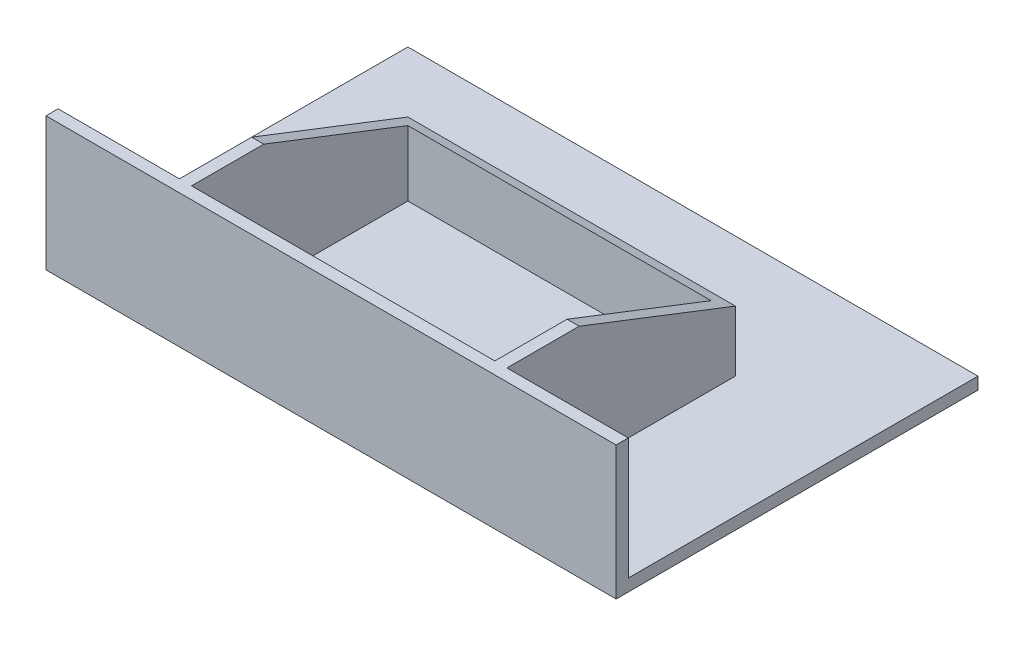
ISO-10303-21;
HEADER;
FILE_DESCRIPTION(('STEP AP214'),'2;1');
FILE_NAME('part.step','',(''),(''),'','','');
FILE_SCHEMA(('AUTOMOTIVE_DESIGN { 1 0 10303 214 1 1 1 1 }'));
ENDSEC;
DATA;
#1=APPLICATION_CONTEXT('core data for automotive mechanical design processes');
#2=APPLICATION_PROTOCOL_DEFINITION('international standard','automotive_design',2000,#1);
#3=PRODUCT_CONTEXT('',#1,'mechanical');
#4=PRODUCT('Part','Part','',(#3));
#5=PRODUCT_RELATED_PRODUCT_CATEGORY('part','',(#4));
#6=PRODUCT_DEFINITION_FORMATION('','',#4);
#7=PRODUCT_DEFINITION_CONTEXT('part definition',#1,'design');
#8=PRODUCT_DEFINITION('design','',#6,#7);
#9=PRODUCT_DEFINITION_SHAPE('','',#8);
#10=(LENGTH_UNIT() NAMED_UNIT(*) SI_UNIT(.MILLI.,.METRE.));
#11=(NAMED_UNIT(*) PLANE_ANGLE_UNIT() SI_UNIT($,.RADIAN.));
#12=(NAMED_UNIT(*) SI_UNIT($,.STERADIAN.) SOLID_ANGLE_UNIT());
#13=UNCERTAINTY_MEASURE_WITH_UNIT(LENGTH_MEASURE(1.E-05),#10,'distance_accuracy_value','');
#14=(GEOMETRIC_REPRESENTATION_CONTEXT(3) GLOBAL_UNCERTAINTY_ASSIGNED_CONTEXT((#13)) GLOBAL_UNIT_ASSIGNED_CONTEXT((#10,
#11,#12)) REPRESENTATION_CONTEXT('',''));
#15=CARTESIAN_POINT('',(0.,0.,0.));
#16=DIRECTION('',(0.,0.,1.));
#17=DIRECTION('',(1.,0.,0.));
#18=AXIS2_PLACEMENT_3D('',#15,#16,#17);
#19=CARTESIAN_POINT('',(0.,0.,0.));
#20=DIRECTION('',(0.,0.,1.));
#21=DIRECTION('',(1.,0.,0.));
#22=AXIS2_PLACEMENT_3D('',#19,#20,#21);
#23=PLANE('',#22);
#24=DIRECTION('',(-1.,0.,0.));
#25=VECTOR('',#24,1.);
#26=CARTESIAN_POINT('',(-47.,0.,0.));
#27=LINE('',#26,#25);
#28=CARTESIAN_POINT('',(-27.,0.,0.));
#29=VERTEX_POINT('',#28);
#30=CARTESIAN_POINT('',(-47.,0.,0.));
#31=VERTEX_POINT('',#30);
#32=EDGE_CURVE('E250',#29,#31,#27,.T.);
#33=ORIENTED_EDGE('',*,*,#32,.T.);
#34=DIRECTION('',(0.,-1.,0.));
#35=VECTOR('',#34,1.);
#36=CARTESIAN_POINT('',(-47.,20.,0.));
#37=LINE('',#36,#35);
#38=CARTESIAN_POINT('',(-47.,20.,0.));
#39=VERTEX_POINT('',#38);
#40=EDGE_CURVE('E100',#39,#31,#37,.T.);
#41=ORIENTED_EDGE('',*,*,#40,.F.);
#42=DIRECTION('',(-1.,0.,0.));
#43=VECTOR('',#42,1.);
#44=CARTESIAN_POINT('',(-47.,20.,0.));
#45=LINE('',#44,#43);
#46=CARTESIAN_POINT('',(-27.,20.,0.));
#47=VERTEX_POINT('',#46);
#48=EDGE_CURVE('E79',#47,#39,#45,.T.);
#49=ORIENTED_EDGE('',*,*,#48,.F.);
#50=DIRECTION('',(0.,-1.,0.));
#51=VECTOR('',#50,1.);
#52=CARTESIAN_POINT('',(-27.,0.,0.));
#53=LINE('',#52,#51);
#54=EDGE_CURVE('E83',#47,#29,#53,.T.);
#55=ORIENTED_EDGE('',*,*,#54,.T.);
#56=EDGE_LOOP('',(#33,#41,#49,#55));
#57=FACE_BOUND('',#56,.T.);
#58=ADVANCED_FACE('F37',(#57),#23,.F.);
#59=CARTESIAN_POINT('',(25.,0.,0.));
#60=VERTEX_POINT('',#59);
#61=CARTESIAN_POINT('',(-25.,0.,0.));
#62=VERTEX_POINT('',#61);
#63=EDGE_CURVE('E248',#60,#62,#27,.T.);
#64=ORIENTED_EDGE('',*,*,#63,.T.);
#65=DIRECTION('',(0.,1.,0.));
#66=VECTOR('',#65,1.);
#67=CARTESIAN_POINT('',(-25.,-61.4143647298425,0.));
#68=LINE('',#67,#66);
#69=CARTESIAN_POINT('',(-25.,20.,0.));
#70=VERTEX_POINT('',#69);
#71=EDGE_CURVE('E151',#62,#70,#68,.T.);
#72=ORIENTED_EDGE('',*,*,#71,.T.);
#73=CARTESIAN_POINT('',(25.,20.,0.));
#74=VERTEX_POINT('',#73);
#75=EDGE_CURVE('E101',#74,#70,#45,.T.);
#76=ORIENTED_EDGE('',*,*,#75,.F.);
#77=DIRECTION('',(0.,1.,0.));
#78=VECTOR('',#77,1.);
#79=CARTESIAN_POINT('',(25.,-61.4143647298425,0.));
#80=LINE('',#79,#78);
#81=EDGE_CURVE('E157',#60,#74,#80,.T.);
#82=ORIENTED_EDGE('',*,*,#81,.F.);
#83=EDGE_LOOP('',(#64,#72,#76,#82));
#84=FACE_BOUND('',#83,.T.);
#85=ADVANCED_FACE('F222',(#84),#23,.F.);
#86=CARTESIAN_POINT('',(47.,0.,0.));
#87=VERTEX_POINT('',#86);
#88=CARTESIAN_POINT('',(27.,0.,0.));
#89=VERTEX_POINT('',#88);
#90=EDGE_CURVE('E239',#87,#89,#27,.T.);
#91=ORIENTED_EDGE('',*,*,#90,.T.);
#92=DIRECTION('',(0.,-1.,0.));
#93=VECTOR('',#92,1.);
#94=CARTESIAN_POINT('',(27.,0.,0.));
#95=LINE('',#94,#93);
#96=CARTESIAN_POINT('',(27.,20.,0.));
#97=VERTEX_POINT('',#96);
#98=EDGE_CURVE('E182',#97,#89,#95,.T.);
#99=ORIENTED_EDGE('',*,*,#98,.F.);
#100=CARTESIAN_POINT('',(47.,20.,0.));
#101=VERTEX_POINT('',#100);
#102=EDGE_CURVE('E104',#101,#97,#45,.T.);
#103=ORIENTED_EDGE('',*,*,#102,.F.);
#104=DIRECTION('',(0.,1.,0.));
#105=VECTOR('',#104,1.);
#106=CARTESIAN_POINT('',(47.,20.,0.));
#107=LINE('',#106,#105);
#108=EDGE_CURVE('E102',#87,#101,#107,.T.);
#109=ORIENTED_EDGE('',*,*,#108,.F.);
#110=EDGE_LOOP('',(#91,#99,#103,#109));
#111=FACE_BOUND('',#110,.T.);
#112=ADVANCED_FACE('F207',(#111),#23,.F.);
#113=CARTESIAN_POINT('',(27.,5.,-4.));
#114=DIRECTION('',(-1.,0.,0.));
#115=DIRECTION('',(0.,0.,1.));
#116=AXIS2_PLACEMENT_3D('',#113,#114,#115);
#117=CYLINDRICAL_SURFACE('',#116,2.1);
#118=CARTESIAN_POINT('',(-25.,5.,-4.));
#119=DIRECTION('',(-1.,0.,0.));
#120=DIRECTION('',(0.,0.,1.));
#121=AXIS2_PLACEMENT_3D('',#118,#119,#120);
#122=CIRCLE('',#121,2.1);
#123=CARTESIAN_POINT('',(-25.,5.,-1.9));
#124=VERTEX_POINT('',#123);
#125=EDGE_CURVE('E165',#124,#124,#122,.T.);
#126=ORIENTED_EDGE('',*,*,#125,.F.);
#127=EDGE_LOOP('',(#126));
#128=FACE_BOUND('',#127,.T.);
#129=CARTESIAN_POINT('',(-27.,5.,-4.));
#130=DIRECTION('',(1.,0.,0.));
#131=DIRECTION('',(0.,0.,-1.));
#132=AXIS2_PLACEMENT_3D('',#129,#130,#131);
#133=CIRCLE('',#132,2.1);
#134=CARTESIAN_POINT('',(-27.,5.,-6.1));
#135=VERTEX_POINT('',#134);
#136=EDGE_CURVE('E169',#135,#135,#133,.T.);
#137=ORIENTED_EDGE('',*,*,#136,.F.);
#138=EDGE_LOOP('',(#137));
#139=FACE_BOUND('',#138,.T.);
#140=ADVANCED_FACE('F203',(#128,#139),#117,.F.);
#141=CARTESIAN_POINT('',(27.,0.,0.));
#142=DIRECTION('',(-1.,0.,0.));
#143=DIRECTION('',(0.,0.,1.));
#144=AXIS2_PLACEMENT_3D('',#141,#142,#143);
#145=PLANE('',#144);
#146=DIRECTION('',(0.,0.,-1.));
#147=VECTOR('',#146,1.);
#148=CARTESIAN_POINT('',(27.,0.,-37.6612421989213));
#149=LINE('',#148,#147);
#150=CARTESIAN_POINT('',(27.,0.,-37.6612421989213));
#151=VERTEX_POINT('',#150);
#152=EDGE_CURVE('E96',#89,#151,#149,.T.);
#153=ORIENTED_EDGE('',*,*,#152,.T.);
#154=DIRECTION('',(0.,1.,0.));
#155=VECTOR('',#154,1.);
#156=CARTESIAN_POINT('',(27.,10.,-37.6612421989213));
#157=LINE('',#156,#155);
#158=CARTESIAN_POINT('',(27.,10.,-37.6612421989213));
#159=VERTEX_POINT('',#158);
#160=EDGE_CURVE('E177',#151,#159,#157,.T.);
#161=ORIENTED_EDGE('',*,*,#160,.T.);
#162=DIRECTION('',(0.,0.361963982515908,0.932192080722221));
#163=VECTOR('',#162,1.);
#164=CARTESIAN_POINT('',(27.,20.,-11.9075173602559));
#165=LINE('',#164,#163);
#166=CARTESIAN_POINT('',(27.,20.,-11.9075173602559));
#167=VERTEX_POINT('',#166);
#168=EDGE_CURVE('E54',#159,#167,#165,.T.);
#169=ORIENTED_EDGE('',*,*,#168,.T.);
#170=DIRECTION('',(0.,0.,1.));
#171=VECTOR('',#170,1.);
#172=CARTESIAN_POINT('',(27.,20.,0.));
#173=LINE('',#172,#171);
#174=EDGE_CURVE('E180',#167,#97,#173,.T.);
#175=ORIENTED_EDGE('',*,*,#174,.T.);
#176=ORIENTED_EDGE('',*,*,#98,.T.);
#177=EDGE_LOOP('',(#153,#161,#169,#175,#176));
#178=FACE_BOUND('',#177,.T.);
#179=CARTESIAN_POINT('',(27.,5.,-4.));
#180=DIRECTION('',(1.,0.,0.));
#181=DIRECTION('',(0.,0.,-1.));
#182=AXIS2_PLACEMENT_3D('',#179,#180,#181);
#183=CIRCLE('',#182,2.1);
#184=CARTESIAN_POINT('',(27.,5.,-6.1));
#185=VERTEX_POINT('',#184);
#186=EDGE_CURVE('E170',#185,#185,#183,.T.);
#187=ORIENTED_EDGE('',*,*,#186,.F.);
#188=EDGE_LOOP('',(#187));
#189=FACE_BOUND('',#188,.T.);
#190=ADVANCED_FACE('F206',(#178,#189),#145,.F.);
#191=CARTESIAN_POINT('',(-27.,0.,0.));
#192=DIRECTION('',(-1.,0.,0.));
#193=DIRECTION('',(0.,0.,1.));
#194=AXIS2_PLACEMENT_3D('',#191,#192,#193);
#195=PLANE('',#194);
#196=DIRECTION('',(0.,0.,-1.));
#197=VECTOR('',#196,1.);
#198=CARTESIAN_POINT('',(-27.,0.,-37.6612421989213));
#199=LINE('',#198,#197);
#200=CARTESIAN_POINT('',(-27.,0.,-37.6612421989213));
#201=VERTEX_POINT('',#200);
#202=EDGE_CURVE('E93',#29,#201,#199,.T.);
#203=ORIENTED_EDGE('',*,*,#202,.F.);
#204=ORIENTED_EDGE('',*,*,#54,.F.);
#205=DIRECTION('',(0.,0.,1.));
#206=VECTOR('',#205,1.);
#207=CARTESIAN_POINT('',(-27.,20.,0.));
#208=LINE('',#207,#206);
#209=CARTESIAN_POINT('',(-27.,20.,-11.9075173602559));
#210=VERTEX_POINT('',#209);
#211=EDGE_CURVE('E72',#210,#47,#208,.T.);
#212=ORIENTED_EDGE('',*,*,#211,.F.);
#213=DIRECTION('',(0.,0.361963982515908,0.932192080722221));
#214=VECTOR('',#213,1.);
#215=CARTESIAN_POINT('',(-27.,20.,-11.9075173602559));
#216=LINE('',#215,#214);
#217=CARTESIAN_POINT('',(-27.,10.,-37.6612421989213));
#218=VERTEX_POINT('',#217);
#219=EDGE_CURVE('E84',#218,#210,#216,.T.);
#220=ORIENTED_EDGE('',*,*,#219,.F.);
#221=DIRECTION('',(0.,1.,0.));
#222=VECTOR('',#221,1.);
#223=CARTESIAN_POINT('',(-27.,10.,-37.6612421989213));
#224=LINE('',#223,#222);
#225=EDGE_CURVE('E186',#201,#218,#224,.T.);
#226=ORIENTED_EDGE('',*,*,#225,.F.);
#227=EDGE_LOOP('',(#203,#204,#212,#220,#226));
#228=FACE_BOUND('',#227,.T.);
#229=ORIENTED_EDGE('',*,*,#136,.T.);
#230=EDGE_LOOP('',(#229));
#231=FACE_BOUND('',#230,.T.);
#232=ADVANCED_FACE('F88',(#228,#231),#195,.T.);
#233=CARTESIAN_POINT('',(27.,10.,-37.6612421989213));
#234=DIRECTION('',(0.,0.,1.));
#235=DIRECTION('',(1.,0.,0.));
#236=AXIS2_PLACEMENT_3D('',#233,#234,#235);
#237=PLANE('',#236);
#238=ORIENTED_EDGE('',*,*,#225,.T.);
#239=DIRECTION('',(-1.,0.,0.));
#240=VECTOR('',#239,1.);
#241=CARTESIAN_POINT('',(27.,10.,-37.6612421989213));
#242=LINE('',#241,#240);
#243=EDGE_CURVE('E191',#159,#218,#242,.T.);
#244=ORIENTED_EDGE('',*,*,#243,.F.);
#245=ORIENTED_EDGE('',*,*,#160,.F.);
#246=DIRECTION('',(-1.,0.,0.));
#247=VECTOR('',#246,1.);
#248=CARTESIAN_POINT('',(27.,0.,-37.6612421989213));
#249=LINE('',#248,#247);
#250=EDGE_CURVE('E46',#151,#201,#249,.T.);
#251=ORIENTED_EDGE('',*,*,#250,.T.);
#252=EDGE_LOOP('',(#238,#244,#245,#251));
#253=FACE_BOUND('',#252,.T.);
#254=ADVANCED_FACE('F39',(#253),#237,.F.);
#255=CARTESIAN_POINT('',(27.,20.,-11.9075173602559));
#256=DIRECTION('',(0.,-0.932192080722221,0.361963982515908));
#257=DIRECTION('',(0.,-0.361963982515908,-0.932192080722221));
#258=AXIS2_PLACEMENT_3D('',#255,#256,#257);
#259=PLANE('',#258);
#260=DIRECTION('',(-1.,0.,0.));
#261=VECTOR('',#260,1.);
#262=CARTESIAN_POINT('',(27.,20.,-11.9075173602559));
#263=LINE('',#262,#261);
#264=CARTESIAN_POINT('',(-25.,20.,-11.9075173602559));
#265=VERTEX_POINT('',#264);
#266=EDGE_CURVE('E68',#265,#210,#263,.T.);
#267=ORIENTED_EDGE('',*,*,#266,.F.);
#268=DIRECTION('',(0.,-0.361963982515908,-0.932192080722221));
#269=VECTOR('',#268,1.);
#270=CARTESIAN_POINT('',(-25.,20.,-11.9075173602559));
#271=LINE('',#270,#269);
#272=CARTESIAN_POINT('',(-25.,10.7765866928101,-35.6612421989213));
#273=VERTEX_POINT('',#272);
#274=EDGE_CURVE('E166',#265,#273,#271,.T.);
#275=ORIENTED_EDGE('',*,*,#274,.T.);
#276=DIRECTION('',(1.,0.,0.));
#277=VECTOR('',#276,1.);
#278=CARTESIAN_POINT('',(27.,10.7765866928101,-35.6612421989213));
#279=LINE('',#278,#277);
#280=CARTESIAN_POINT('',(25.,10.7765866928101,-35.6612421989213));
#281=VERTEX_POINT('',#280);
#282=EDGE_CURVE('E11',#273,#281,#279,.T.);
#283=ORIENTED_EDGE('',*,*,#282,.T.);
#284=DIRECTION('',(0.,0.361963982515908,0.932192080722221));
#285=VECTOR('',#284,1.);
#286=CARTESIAN_POINT('',(25.,20.,-11.9075173602559));
#287=LINE('',#286,#285);
#288=CARTESIAN_POINT('',(25.,20.,-11.9075173602559));
#289=VERTEX_POINT('',#288);
#290=EDGE_CURVE('E162',#281,#289,#287,.T.);
#291=ORIENTED_EDGE('',*,*,#290,.T.);
#292=EDGE_CURVE('E189',#167,#289,#263,.T.);
#293=ORIENTED_EDGE('',*,*,#292,.F.);
#294=ORIENTED_EDGE('',*,*,#168,.F.);
#295=ORIENTED_EDGE('',*,*,#243,.T.);
#296=ORIENTED_EDGE('',*,*,#219,.T.);
#297=EDGE_LOOP('',(#267,#275,#283,#291,#293,#294,#295,#296));
#298=FACE_BOUND('',#297,.T.);
#299=ADVANCED_FACE('F217',(#298),#259,.F.);
#300=CARTESIAN_POINT('',(27.,20.,0.));
#301=DIRECTION('',(0.,-1.,0.));
#302=DIRECTION('',(0.,0.,-1.));
#303=AXIS2_PLACEMENT_3D('',#300,#301,#302);
#304=PLANE('',#303);
#305=ORIENTED_EDGE('',*,*,#292,.T.);
#306=DIRECTION('',(0.,0.,-1.));
#307=VECTOR('',#306,1.);
#308=CARTESIAN_POINT('',(25.,20.,0.));
#309=LINE('',#308,#307);
#310=EDGE_CURVE('E148',#74,#289,#309,.T.);
#311=ORIENTED_EDGE('',*,*,#310,.F.);
#312=ORIENTED_EDGE('',*,*,#75,.T.);
#313=DIRECTION('',(0.,0.,1.));
#314=VECTOR('',#313,1.);
#315=CARTESIAN_POINT('',(-25.,20.,0.));
#316=LINE('',#315,#314);
#317=EDGE_CURVE('E134',#265,#70,#316,.T.);
#318=ORIENTED_EDGE('',*,*,#317,.F.);
#319=ORIENTED_EDGE('',*,*,#266,.T.);
#320=ORIENTED_EDGE('',*,*,#211,.T.);
#321=ORIENTED_EDGE('',*,*,#48,.T.);
#322=DIRECTION('',(0.,0.,-1.));
#323=VECTOR('',#322,1.);
#324=CARTESIAN_POINT('',(-47.,20.,2.));
#325=LINE('',#324,#323);
#326=CARTESIAN_POINT('',(-47.,20.,2.));
#327=VERTEX_POINT('',#326);
#328=EDGE_CURVE('E130',#327,#39,#325,.T.);
#329=ORIENTED_EDGE('',*,*,#328,.F.);
#330=DIRECTION('',(-1.,0.,0.));
#331=VECTOR('',#330,1.);
#332=CARTESIAN_POINT('',(-47.,20.,2.));
#333=LINE('',#332,#331);
#334=CARTESIAN_POINT('',(47.,20.,2.));
#335=VERTEX_POINT('',#334);
#336=EDGE_CURVE('E120',#335,#327,#333,.T.);
#337=ORIENTED_EDGE('',*,*,#336,.F.);
#338=DIRECTION('',(0.,0.,-1.));
#339=VECTOR('',#338,1.);
#340=CARTESIAN_POINT('',(47.,20.,2.));
#341=LINE('',#340,#339);
#342=EDGE_CURVE('E132',#335,#101,#341,.T.);
#343=ORIENTED_EDGE('',*,*,#342,.T.);
#344=ORIENTED_EDGE('',*,*,#102,.T.);
#345=ORIENTED_EDGE('',*,*,#174,.F.);
#346=EDGE_LOOP('',(#305,#311,#312,#318,#319,#320,#321,#329,#337,#343,#344,#345));
#347=FACE_BOUND('',#346,.T.);
#348=ADVANCED_FACE('F75',(#347),#304,.F.);
#349=CARTESIAN_POINT('',(25.,5.,-4.));
#350=DIRECTION('',(1.,0.,0.));
#351=DIRECTION('',(0.,0.,-1.));
#352=AXIS2_PLACEMENT_3D('',#349,#350,#351);
#353=CIRCLE('',#352,2.1);
#354=CARTESIAN_POINT('',(25.,5.,-6.1));
#355=VERTEX_POINT('',#354);
#356=EDGE_CURVE('E145',#355,#355,#353,.T.);
#357=ORIENTED_EDGE('',*,*,#356,.F.);
#358=EDGE_LOOP('',(#357));
#359=FACE_BOUND('',#358,.T.);
#360=ORIENTED_EDGE('',*,*,#186,.T.);
#361=EDGE_LOOP('',(#360));
#362=FACE_BOUND('',#361,.T.);
#363=ADVANCED_FACE('F209',(#359,#362),#117,.F.);
#364=CARTESIAN_POINT('',(-25.,-61.4143647298425,-35.6612421989213));
#365=DIRECTION('',(0.,0.,-1.));
#366=DIRECTION('',(-1.,0.,0.));
#367=AXIS2_PLACEMENT_3D('',#364,#365,#366);
#368=PLANE('',#367);
#369=DIRECTION('',(0.,1.,0.));
#370=VECTOR('',#369,1.);
#371=CARTESIAN_POINT('',(-25.,-61.4143647298425,-35.6612421989213));
#372=LINE('',#371,#370);
#373=CARTESIAN_POINT('',(-25.,0.,-35.6612421989213));
#374=VERTEX_POINT('',#373);
#375=EDGE_CURVE('E139',#374,#273,#372,.T.);
#376=ORIENTED_EDGE('',*,*,#375,.F.);
#377=DIRECTION('',(1.,0.,0.));
#378=VECTOR('',#377,1.);
#379=CARTESIAN_POINT('',(-25.,0.,-35.6612421989213));
#380=LINE('',#379,#378);
#381=CARTESIAN_POINT('',(25.,0.,-35.6612421989213));
#382=VERTEX_POINT('',#381);
#383=EDGE_CURVE('E138',#374,#382,#380,.T.);
#384=ORIENTED_EDGE('',*,*,#383,.T.);
#385=DIRECTION('',(0.,1.,0.));
#386=VECTOR('',#385,1.);
#387=CARTESIAN_POINT('',(25.,-61.4143647298425,-35.6612421989213));
#388=LINE('',#387,#386);
#389=EDGE_CURVE('E154',#382,#281,#388,.T.);
#390=ORIENTED_EDGE('',*,*,#389,.T.);
#391=ORIENTED_EDGE('',*,*,#282,.F.);
#392=EDGE_LOOP('',(#376,#384,#390,#391));
#393=FACE_BOUND('',#392,.T.);
#394=ADVANCED_FACE('F273',(#393),#368,.F.);
#395=CARTESIAN_POINT('',(-25.,-61.4143647298425,0.));
#396=DIRECTION('',(-1.,0.,0.));
#397=DIRECTION('',(0.,0.,1.));
#398=AXIS2_PLACEMENT_3D('',#395,#396,#397);
#399=PLANE('',#398);
#400=ORIENTED_EDGE('',*,*,#125,.T.);
#401=EDGE_LOOP('',(#400));
#402=FACE_BOUND('',#401,.T.);
#403=ORIENTED_EDGE('',*,*,#317,.T.);
#404=ORIENTED_EDGE('',*,*,#71,.F.);
#405=DIRECTION('',(0.,0.,-1.));
#406=VECTOR('',#405,1.);
#407=CARTESIAN_POINT('',(-25.,0.,0.));
#408=LINE('',#407,#406);
#409=EDGE_CURVE('E142',#62,#374,#408,.T.);
#410=ORIENTED_EDGE('',*,*,#409,.T.);
#411=ORIENTED_EDGE('',*,*,#375,.T.);
#412=ORIENTED_EDGE('',*,*,#274,.F.);
#413=EDGE_LOOP('',(#403,#404,#410,#411,#412));
#414=FACE_BOUND('',#413,.T.);
#415=ADVANCED_FACE('F200',(#402,#414),#399,.F.);
#416=CARTESIAN_POINT('',(25.,-61.4143647298425,0.));
#417=DIRECTION('',(1.,0.,0.));
#418=DIRECTION('',(0.,0.,-1.));
#419=AXIS2_PLACEMENT_3D('',#416,#417,#418);
#420=PLANE('',#419);
#421=ORIENTED_EDGE('',*,*,#356,.T.);
#422=EDGE_LOOP('',(#421));
#423=FACE_BOUND('',#422,.T.);
#424=ORIENTED_EDGE('',*,*,#389,.F.);
#425=DIRECTION('',(0.,0.,1.));
#426=VECTOR('',#425,1.);
#427=CARTESIAN_POINT('',(25.,0.,0.));
#428=LINE('',#427,#426);
#429=EDGE_CURVE('E135',#382,#60,#428,.T.);
#430=ORIENTED_EDGE('',*,*,#429,.T.);
#431=ORIENTED_EDGE('',*,*,#81,.T.);
#432=ORIENTED_EDGE('',*,*,#310,.T.);
#433=ORIENTED_EDGE('',*,*,#290,.F.);
#434=EDGE_LOOP('',(#424,#430,#431,#432,#433));
#435=FACE_BOUND('',#434,.T.);
#436=ADVANCED_FACE('F267',(#423,#435),#420,.F.);
#437=CARTESIAN_POINT('',(47.,20.,2.));
#438=DIRECTION('',(-1.,0.,0.));
#439=DIRECTION('',(0.,0.,1.));
#440=AXIS2_PLACEMENT_3D('',#437,#438,#439);
#441=PLANE('',#440);
#442=DIRECTION('',(0.,0.,-1.));
#443=VECTOR('',#442,1.);
#444=CARTESIAN_POINT('',(47.,-2.,2.));
#445=LINE('',#444,#443);
#446=CARTESIAN_POINT('',(47.,-2.,2.));
#447=VERTEX_POINT('',#446);
#448=CARTESIAN_POINT('',(47.,-2.,-57.6612421989213));
#449=VERTEX_POINT('',#448);
#450=EDGE_CURVE('E123',#447,#449,#445,.T.);
#451=ORIENTED_EDGE('',*,*,#450,.T.);
#452=DIRECTION('',(0.,1.,0.));
#453=VECTOR('',#452,1.);
#454=CARTESIAN_POINT('',(47.,-112.276102814357,-57.6612421989213));
#455=LINE('',#454,#453);
#456=CARTESIAN_POINT('',(47.,0.,-57.6612421989213));
#457=VERTEX_POINT('',#456);
#458=EDGE_CURVE('E247',#449,#457,#455,.T.);
#459=ORIENTED_EDGE('',*,*,#458,.T.);
#460=DIRECTION('',(0.,0.,1.));
#461=VECTOR('',#460,1.);
#462=CARTESIAN_POINT('',(47.,0.,0.));
#463=LINE('',#462,#461);
#464=EDGE_CURVE('E342',#457,#87,#463,.T.);
#465=ORIENTED_EDGE('',*,*,#464,.T.);
#466=ORIENTED_EDGE('',*,*,#108,.T.);
#467=ORIENTED_EDGE('',*,*,#342,.F.);
#468=DIRECTION('',(0.,1.,0.));
#469=VECTOR('',#468,1.);
#470=CARTESIAN_POINT('',(47.,20.,2.));
#471=LINE('',#470,#469);
#472=EDGE_CURVE('E115',#447,#335,#471,.T.);
#473=ORIENTED_EDGE('',*,*,#472,.F.);
#474=EDGE_LOOP('',(#451,#459,#465,#466,#467,#473));
#475=FACE_BOUND('',#474,.T.);
#476=ADVANCED_FACE('F365',(#475),#441,.F.);
#477=CARTESIAN_POINT('',(-47.,20.,2.));
#478=DIRECTION('',(1.,0.,0.));
#479=DIRECTION('',(0.,1.,0.));
#480=AXIS2_PLACEMENT_3D('',#477,#478,#479);
#481=PLANE('',#480);
#482=ORIENTED_EDGE('',*,*,#40,.T.);
#483=DIRECTION('',(0.,0.,-1.));
#484=VECTOR('',#483,1.);
#485=CARTESIAN_POINT('',(-47.,0.,0.));
#486=LINE('',#485,#484);
#487=CARTESIAN_POINT('',(-47.,0.,-57.6612421989213));
#488=VERTEX_POINT('',#487);
#489=EDGE_CURVE('E341',#31,#488,#486,.T.);
#490=ORIENTED_EDGE('',*,*,#489,.T.);
#491=DIRECTION('',(0.,1.,0.));
#492=VECTOR('',#491,1.);
#493=CARTESIAN_POINT('',(-47.,-112.276102814357,-57.6612421989213));
#494=LINE('',#493,#492);
#495=CARTESIAN_POINT('',(-47.,-2.,-57.6612421989213));
#496=VERTEX_POINT('',#495);
#497=EDGE_CURVE('E333',#496,#488,#494,.T.);
#498=ORIENTED_EDGE('',*,*,#497,.F.);
#499=DIRECTION('',(0.,0.,-1.));
#500=VECTOR('',#499,1.);
#501=CARTESIAN_POINT('',(-47.,-2.,2.));
#502=LINE('',#501,#500);
#503=CARTESIAN_POINT('',(-47.,-2.,2.));
#504=VERTEX_POINT('',#503);
#505=EDGE_CURVE('E126',#504,#496,#502,.T.);
#506=ORIENTED_EDGE('',*,*,#505,.F.);
#507=DIRECTION('',(0.,-1.,0.));
#508=VECTOR('',#507,1.);
#509=CARTESIAN_POINT('',(-47.,20.,2.));
#510=LINE('',#509,#508);
#511=EDGE_CURVE('E351',#327,#504,#510,.T.);
#512=ORIENTED_EDGE('',*,*,#511,.F.);
#513=ORIENTED_EDGE('',*,*,#328,.T.);
#514=EDGE_LOOP('',(#482,#490,#498,#506,#512,#513));
#515=FACE_BOUND('',#514,.T.);
#516=ADVANCED_FACE('F344',(#515),#481,.F.);
#517=CARTESIAN_POINT('',(-47.,-2.,2.));
#518=DIRECTION('',(0.,1.,0.));
#519=DIRECTION('',(0.,0.,1.));
#520=AXIS2_PLACEMENT_3D('',#517,#518,#519);
#521=PLANE('',#520);
#522=ORIENTED_EDGE('',*,*,#505,.T.);
#523=DIRECTION('',(-1.,0.,0.));
#524=VECTOR('',#523,1.);
#525=CARTESIAN_POINT('',(-47.,-2.,-57.6612421989213));
#526=LINE('',#525,#524);
#527=EDGE_CURVE('E107',#449,#496,#526,.T.);
#528=ORIENTED_EDGE('',*,*,#527,.F.);
#529=ORIENTED_EDGE('',*,*,#450,.F.);
#530=DIRECTION('',(1.,0.,0.));
#531=VECTOR('',#530,1.);
#532=CARTESIAN_POINT('',(-47.,-2.,2.));
#533=LINE('',#532,#531);
#534=EDGE_CURVE('E127',#504,#447,#533,.T.);
#535=ORIENTED_EDGE('',*,*,#534,.F.);
#536=EDGE_LOOP('',(#522,#528,#529,#535));
#537=FACE_BOUND('',#536,.T.);
#538=ADVANCED_FACE('F363',(#537),#521,.F.);
#539=CARTESIAN_POINT('',(0.,0.,2.));
#540=DIRECTION('',(0.,0.,1.));
#541=DIRECTION('',(1.,0.,0.));
#542=AXIS2_PLACEMENT_3D('',#539,#540,#541);
#543=PLANE('',#542);
#544=ORIENTED_EDGE('',*,*,#472,.T.);
#545=ORIENTED_EDGE('',*,*,#336,.T.);
#546=ORIENTED_EDGE('',*,*,#511,.T.);
#547=ORIENTED_EDGE('',*,*,#534,.T.);
#548=EDGE_LOOP('',(#544,#545,#546,#547));
#549=FACE_BOUND('',#548,.T.);
#550=ADVANCED_FACE('F358',(#549),#543,.T.);
#551=CARTESIAN_POINT('',(-47.,-112.276102814357,-57.6612421989213));
#552=DIRECTION('',(0.,0.,1.));
#553=DIRECTION('',(1.,0.,0.));
#554=AXIS2_PLACEMENT_3D('',#551,#552,#553);
#555=PLANE('',#554);
#556=ORIENTED_EDGE('',*,*,#458,.F.);
#557=ORIENTED_EDGE('',*,*,#527,.T.);
#558=ORIENTED_EDGE('',*,*,#497,.T.);
#559=DIRECTION('',(1.,0.,0.));
#560=VECTOR('',#559,1.);
#561=CARTESIAN_POINT('',(-47.,0.,-57.6612421989213));
#562=LINE('',#561,#560);
#563=EDGE_CURVE('E337',#488,#457,#562,.T.);
#564=ORIENTED_EDGE('',*,*,#563,.T.);
#565=EDGE_LOOP('',(#556,#557,#558,#564));
#566=FACE_BOUND('',#565,.T.);
#567=ADVANCED_FACE('F336',(#566),#555,.F.);
#568=CARTESIAN_POINT('',(0.,0.,0.));
#569=DIRECTION('',(0.,-1.,0.));
#570=DIRECTION('',(0.,0.,-1.));
#571=AXIS2_PLACEMENT_3D('',#568,#569,#570);
#572=PLANE('',#571);
#573=ORIENTED_EDGE('',*,*,#250,.F.);
#574=ORIENTED_EDGE('',*,*,#152,.F.);
#575=ORIENTED_EDGE('',*,*,#90,.F.);
#576=ORIENTED_EDGE('',*,*,#464,.F.);
#577=ORIENTED_EDGE('',*,*,#563,.F.);
#578=ORIENTED_EDGE('',*,*,#489,.F.);
#579=ORIENTED_EDGE('',*,*,#32,.F.);
#580=ORIENTED_EDGE('',*,*,#202,.T.);
#581=EDGE_LOOP('',(#573,#574,#575,#576,#577,#578,#579,#580));
#582=FACE_BOUND('',#581,.T.);
#583=ADVANCED_FACE('F294',(#582),#572,.F.);
#584=ORIENTED_EDGE('',*,*,#383,.F.);
#585=ORIENTED_EDGE('',*,*,#409,.F.);
#586=ORIENTED_EDGE('',*,*,#63,.F.);
#587=ORIENTED_EDGE('',*,*,#429,.F.);
#588=EDGE_LOOP('',(#584,#585,#586,#587));
#589=FACE_BOUND('',#588,.T.);
#590=ADVANCED_FACE('F279',(#589),#572,.F.);
#591=CLOSED_SHELL('',(#58,#85,#112,#140,#190,#232,#254,#299,#348,#363,#394,#415,#436,#476,#516,
#538,#550,#567,#583,#590));
#592=MANIFOLD_SOLID_BREP('B2',#591);
#593=ADVANCED_BREP_SHAPE_REPRESENTATION('',(#18,#592),#14);
#594=SHAPE_DEFINITION_REPRESENTATION(#9,#593);
ENDSEC;
END-ISO-10303-21;
